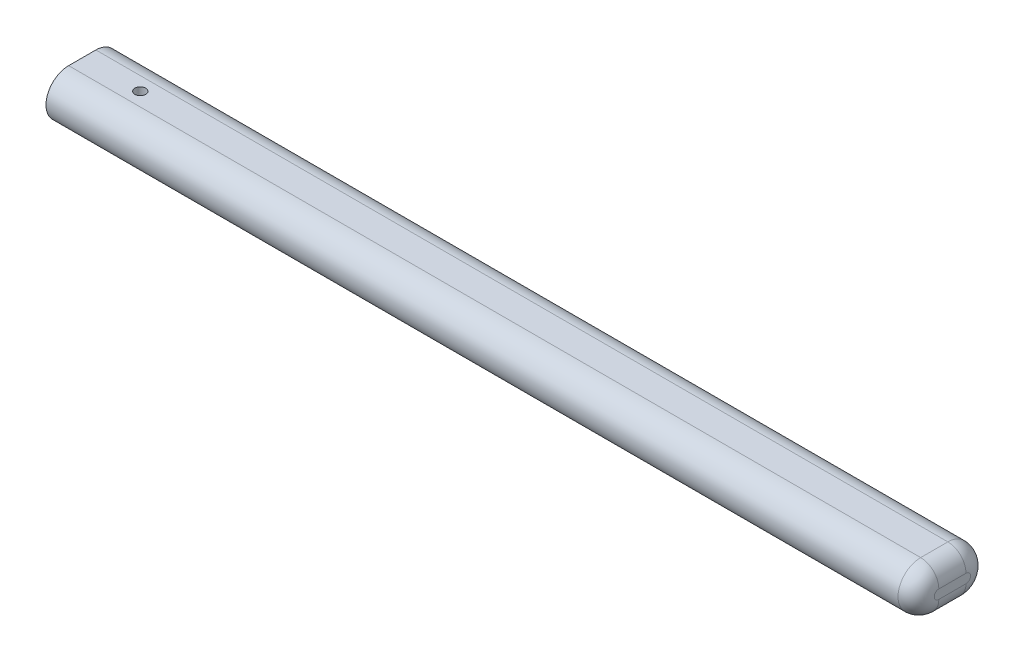
ISO-10303-21;
HEADER;
FILE_DESCRIPTION(('STEP AP214'),'2;1');
FILE_NAME('part.step','',(''),(''),'','','');
FILE_SCHEMA(('AUTOMOTIVE_DESIGN { 1 0 10303 214 1 1 1 1 }'));
ENDSEC;
DATA;
#1=APPLICATION_CONTEXT('core data for automotive mechanical design processes');
#2=APPLICATION_PROTOCOL_DEFINITION('international standard','automotive_design',2000,#1);
#3=PRODUCT_CONTEXT('',#1,'mechanical');
#4=PRODUCT('Part','Part','',(#3));
#5=PRODUCT_RELATED_PRODUCT_CATEGORY('part','',(#4));
#6=PRODUCT_DEFINITION_FORMATION('','',#4);
#7=PRODUCT_DEFINITION_CONTEXT('part definition',#1,'design');
#8=PRODUCT_DEFINITION('design','',#6,#7);
#9=PRODUCT_DEFINITION_SHAPE('','',#8);
#10=(LENGTH_UNIT() NAMED_UNIT(*) SI_UNIT(.MILLI.,.METRE.));
#11=(NAMED_UNIT(*) PLANE_ANGLE_UNIT() SI_UNIT($,.RADIAN.));
#12=(NAMED_UNIT(*) SI_UNIT($,.STERADIAN.) SOLID_ANGLE_UNIT());
#13=UNCERTAINTY_MEASURE_WITH_UNIT(LENGTH_MEASURE(1.E-05),#10,'distance_accuracy_value','');
#14=(GEOMETRIC_REPRESENTATION_CONTEXT(3) GLOBAL_UNCERTAINTY_ASSIGNED_CONTEXT((#13)) GLOBAL_UNIT_ASSIGNED_CONTEXT((#10,
#11,#12)) REPRESENTATION_CONTEXT('',''));
#15=CARTESIAN_POINT('',(0.,0.,0.));
#16=DIRECTION('',(0.,0.,1.));
#17=DIRECTION('',(1.,0.,0.));
#18=AXIS2_PLACEMENT_3D('',#15,#16,#17);
#19=CARTESIAN_POINT('',(480.,0.,0.));
#20=DIRECTION('',(-1.,0.,0.));
#21=DIRECTION('',(0.,0.,1.));
#22=AXIS2_PLACEMENT_3D('',#19,#20,#21);
#23=CYLINDRICAL_SURFACE('',#22,12.5);
#24=DIRECTION('',(-1.,0.,0.));
#25=VECTOR('',#24,1.);
#26=CARTESIAN_POINT('',(480.,-12.5,0.));
#27=LINE('',#26,#25);
#28=CARTESIAN_POINT('',(470.,-12.5,0.));
#29=VERTEX_POINT('',#28);
#30=CARTESIAN_POINT('',(0.,-12.5,0.));
#31=VERTEX_POINT('',#30);
#32=EDGE_CURVE('E85',#29,#31,#27,.T.);
#33=ORIENTED_EDGE('',*,*,#32,.F.);
#34=CARTESIAN_POINT('',(470.,0.,0.));
#35=DIRECTION('',(1.,0.,0.));
#36=DIRECTION('',(0.,0.,-1.));
#37=AXIS2_PLACEMENT_3D('',#34,#35,#36);
#38=CIRCLE('',#37,12.5);
#39=CARTESIAN_POINT('',(470.,12.5,0.));
#40=VERTEX_POINT('',#39);
#41=EDGE_CURVE('E11',#29,#40,#38,.F.);
#42=ORIENTED_EDGE('',*,*,#41,.T.);
#43=DIRECTION('',(-1.,0.,0.));
#44=VECTOR('',#43,1.);
#45=CARTESIAN_POINT('',(480.,12.5,0.));
#46=LINE('',#45,#44);
#47=CARTESIAN_POINT('',(0.,12.5,0.));
#48=VERTEX_POINT('',#47);
#49=EDGE_CURVE('E105',#40,#48,#46,.T.);
#50=ORIENTED_EDGE('',*,*,#49,.T.);
#51=CARTESIAN_POINT('',(0.,0.,0.));
#52=DIRECTION('',(1.,0.,0.));
#53=DIRECTION('',(0.,0.,-1.));
#54=AXIS2_PLACEMENT_3D('',#51,#52,#53);
#55=CIRCLE('',#54,12.5);
#56=EDGE_CURVE('E100',#48,#31,#55,.T.);
#57=ORIENTED_EDGE('',*,*,#56,.T.);
#58=EDGE_LOOP('',(#33,#42,#50,#57));
#59=FACE_BOUND('',#58,.T.);
#60=ADVANCED_FACE('F33',(#59),#23,.T.);
#61=CARTESIAN_POINT('',(480.,-12.5,0.));
#62=DIRECTION('',(0.,1.,0.));
#63=DIRECTION('',(0.,0.,1.));
#64=AXIS2_PLACEMENT_3D('',#61,#62,#63);
#65=PLANE('',#64);
#66=CARTESIAN_POINT('',(32.,-12.5,-7.5));
#67=DIRECTION('',(0.,1.,0.));
#68=DIRECTION('',(0.,0.,1.));
#69=AXIS2_PLACEMENT_3D('',#66,#67,#68);
#70=CIRCLE('',#69,3.);
#71=CARTESIAN_POINT('',(32.,-12.5,-4.5));
#72=VERTEX_POINT('',#71);
#73=EDGE_CURVE('E111',#72,#72,#70,.F.);
#74=ORIENTED_EDGE('',*,*,#73,.F.);
#75=EDGE_LOOP('',(#74));
#76=FACE_BOUND('',#75,.T.);
#77=DIRECTION('',(-1.,0.,0.));
#78=VECTOR('',#77,1.);
#79=CARTESIAN_POINT('',(480.,-12.5,-15.));
#80=LINE('',#79,#78);
#81=CARTESIAN_POINT('',(470.,-12.5,-15.));
#82=VERTEX_POINT('',#81);
#83=CARTESIAN_POINT('',(0.,-12.5,-15.));
#84=VERTEX_POINT('',#83);
#85=EDGE_CURVE('E94',#82,#84,#80,.T.);
#86=ORIENTED_EDGE('',*,*,#85,.F.);
#87=DIRECTION('',(0.,0.,-1.));
#88=VECTOR('',#87,1.);
#89=CARTESIAN_POINT('',(470.,-12.5,0.));
#90=LINE('',#89,#88);
#91=EDGE_CURVE('E42',#82,#29,#90,.F.);
#92=ORIENTED_EDGE('',*,*,#91,.T.);
#93=ORIENTED_EDGE('',*,*,#32,.T.);
#94=DIRECTION('',(0.,0.,-1.));
#95=VECTOR('',#94,1.);
#96=CARTESIAN_POINT('',(0.,-12.5,0.));
#97=LINE('',#96,#95);
#98=EDGE_CURVE('E88',#31,#84,#97,.T.);
#99=ORIENTED_EDGE('',*,*,#98,.T.);
#100=EDGE_LOOP('',(#86,#92,#93,#99));
#101=FACE_BOUND('',#100,.T.);
#102=ADVANCED_FACE('F87',(#76,#101),#65,.F.);
#103=CARTESIAN_POINT('',(480.,0.,-15.));
#104=DIRECTION('',(-1.,0.,0.));
#105=DIRECTION('',(0.,0.,1.));
#106=AXIS2_PLACEMENT_3D('',#103,#104,#105);
#107=CYLINDRICAL_SURFACE('',#106,12.5);
#108=DIRECTION('',(-1.,0.,0.));
#109=VECTOR('',#108,1.);
#110=CARTESIAN_POINT('',(480.,12.5,-15.));
#111=LINE('',#110,#109);
#112=CARTESIAN_POINT('',(470.,12.5,-15.));
#113=VERTEX_POINT('',#112);
#114=CARTESIAN_POINT('',(0.,12.5,-15.));
#115=VERTEX_POINT('',#114);
#116=EDGE_CURVE('E118',#113,#115,#111,.T.);
#117=ORIENTED_EDGE('',*,*,#116,.F.);
#118=CARTESIAN_POINT('',(470.,0.,-15.));
#119=DIRECTION('',(1.,0.,0.));
#120=DIRECTION('',(0.,0.,-1.));
#121=AXIS2_PLACEMENT_3D('',#118,#119,#120);
#122=CIRCLE('',#121,12.5);
#123=EDGE_CURVE('E57',#113,#82,#122,.F.);
#124=ORIENTED_EDGE('',*,*,#123,.T.);
#125=ORIENTED_EDGE('',*,*,#85,.T.);
#126=CARTESIAN_POINT('',(0.,0.,-15.));
#127=DIRECTION('',(1.,0.,0.));
#128=DIRECTION('',(0.,0.,-1.));
#129=AXIS2_PLACEMENT_3D('',#126,#127,#128);
#130=CIRCLE('',#129,12.5);
#131=EDGE_CURVE('E102',#84,#115,#130,.T.);
#132=ORIENTED_EDGE('',*,*,#131,.T.);
#133=EDGE_LOOP('',(#117,#124,#125,#132));
#134=FACE_BOUND('',#133,.T.);
#135=ADVANCED_FACE('F156',(#134),#107,.T.);
#136=CARTESIAN_POINT('',(480.,12.5,0.));
#137=DIRECTION('',(0.,-1.,0.));
#138=DIRECTION('',(0.,0.,-1.));
#139=AXIS2_PLACEMENT_3D('',#136,#137,#138);
#140=PLANE('',#139);
#141=CARTESIAN_POINT('',(32.,12.5,-7.5));
#142=DIRECTION('',(0.,1.,0.));
#143=DIRECTION('',(0.,0.,1.));
#144=AXIS2_PLACEMENT_3D('',#141,#142,#143);
#145=CIRCLE('',#144,3.);
#146=CARTESIAN_POINT('',(32.,12.5,-4.5));
#147=VERTEX_POINT('',#146);
#148=EDGE_CURVE('E200',#147,#147,#145,.T.);
#149=ORIENTED_EDGE('',*,*,#148,.F.);
#150=EDGE_LOOP('',(#149));
#151=FACE_BOUND('',#150,.T.);
#152=ORIENTED_EDGE('',*,*,#49,.F.);
#153=DIRECTION('',(0.,0.,1.));
#154=VECTOR('',#153,1.);
#155=CARTESIAN_POINT('',(470.,12.5,-15.));
#156=LINE('',#155,#154);
#157=EDGE_CURVE('E129',#40,#113,#156,.F.);
#158=ORIENTED_EDGE('',*,*,#157,.T.);
#159=ORIENTED_EDGE('',*,*,#116,.T.);
#160=DIRECTION('',(0.,0.,1.));
#161=VECTOR('',#160,1.);
#162=CARTESIAN_POINT('',(0.,12.5,0.));
#163=LINE('',#162,#161);
#164=EDGE_CURVE('E115',#115,#48,#163,.T.);
#165=ORIENTED_EDGE('',*,*,#164,.T.);
#166=EDGE_LOOP('',(#152,#158,#159,#165));
#167=FACE_BOUND('',#166,.T.);
#168=ADVANCED_FACE('F155',(#151,#167),#140,.F.);
#169=CARTESIAN_POINT('',(480.,0.,0.));
#170=DIRECTION('',(1.,0.,0.));
#171=DIRECTION('',(0.,0.,-1.));
#172=AXIS2_PLACEMENT_3D('',#169,#170,#171);
#173=PLANE('',#172);
#174=CARTESIAN_POINT('',(480.,0.,-15.));
#175=DIRECTION('',(1.,0.,0.));
#176=DIRECTION('',(0.,0.,-1.));
#177=AXIS2_PLACEMENT_3D('',#174,#175,#176);
#178=CIRCLE('',#177,2.5);
#179=CARTESIAN_POINT('',(480.,-2.5,-15.));
#180=VERTEX_POINT('',#179);
#181=CARTESIAN_POINT('',(480.,2.5,-15.));
#182=VERTEX_POINT('',#181);
#183=EDGE_CURVE('E124',#180,#182,#178,.T.);
#184=ORIENTED_EDGE('',*,*,#183,.T.);
#185=DIRECTION('',(0.,0.,1.));
#186=VECTOR('',#185,1.);
#187=CARTESIAN_POINT('',(480.,2.5,0.));
#188=LINE('',#187,#186);
#189=CARTESIAN_POINT('',(480.,2.5,0.));
#190=VERTEX_POINT('',#189);
#191=EDGE_CURVE('E126',#182,#190,#188,.T.);
#192=ORIENTED_EDGE('',*,*,#191,.T.);
#193=CARTESIAN_POINT('',(480.,0.,0.));
#194=DIRECTION('',(1.,0.,0.));
#195=DIRECTION('',(0.,0.,-1.));
#196=AXIS2_PLACEMENT_3D('',#193,#194,#195);
#197=CIRCLE('',#196,2.5);
#198=CARTESIAN_POINT('',(480.,-2.5,0.));
#199=VERTEX_POINT('',#198);
#200=EDGE_CURVE('E93',#190,#199,#197,.T.);
#201=ORIENTED_EDGE('',*,*,#200,.T.);
#202=DIRECTION('',(0.,0.,-1.));
#203=VECTOR('',#202,1.);
#204=CARTESIAN_POINT('',(480.,-2.5,-15.));
#205=LINE('',#204,#203);
#206=EDGE_CURVE('E122',#199,#180,#205,.T.);
#207=ORIENTED_EDGE('',*,*,#206,.T.);
#208=EDGE_LOOP('',(#184,#192,#201,#207));
#209=FACE_BOUND('',#208,.T.);
#210=ADVANCED_FACE('F148',(#209),#173,.T.);
#211=CARTESIAN_POINT('',(0.,0.,0.));
#212=DIRECTION('',(1.,0.,0.));
#213=DIRECTION('',(0.,0.,-1.));
#214=AXIS2_PLACEMENT_3D('',#211,#212,#213);
#215=PLANE('',#214);
#216=ORIENTED_EDGE('',*,*,#56,.F.);
#217=ORIENTED_EDGE('',*,*,#164,.F.);
#218=ORIENTED_EDGE('',*,*,#131,.F.);
#219=ORIENTED_EDGE('',*,*,#98,.F.);
#220=EDGE_LOOP('',(#216,#217,#218,#219));
#221=FACE_BOUND('',#220,.T.);
#222=ADVANCED_FACE('F98',(#221),#215,.F.);
#223=CARTESIAN_POINT('',(470.,-2.5,0.));
#224=DIRECTION('',(0.,0.,1.));
#225=DIRECTION('',(1.,0.,0.));
#226=AXIS2_PLACEMENT_3D('',#223,#224,#225);
#227=CYLINDRICAL_SURFACE('',#226,10.);
#228=CARTESIAN_POINT('',(470.,-2.5,0.));
#229=DIRECTION('',(0.,0.,1.));
#230=DIRECTION('',(1.,0.,0.));
#231=AXIS2_PLACEMENT_3D('',#228,#229,#230);
#232=CIRCLE('',#231,10.);
#233=EDGE_CURVE('E109',#29,#199,#232,.T.);
#234=ORIENTED_EDGE('',*,*,#233,.F.);
#235=ORIENTED_EDGE('',*,*,#91,.F.);
#236=CARTESIAN_POINT('',(470.,-2.5,-15.));
#237=DIRECTION('',(0.,0.,-1.));
#238=DIRECTION('',(0.,1.,0.));
#239=AXIS2_PLACEMENT_3D('',#236,#237,#238);
#240=CIRCLE('',#239,10.);
#241=EDGE_CURVE('E37',#180,#82,#240,.T.);
#242=ORIENTED_EDGE('',*,*,#241,.F.);
#243=ORIENTED_EDGE('',*,*,#206,.F.);
#244=EDGE_LOOP('',(#234,#235,#242,#243));
#245=FACE_BOUND('',#244,.T.);
#246=ADVANCED_FACE('F35',(#245),#227,.T.);
#247=CARTESIAN_POINT('',(470.,0.,-15.));
#248=DIRECTION('',(1.,0.,0.));
#249=DIRECTION('',(0.,0.,-1.));
#250=AXIS2_PLACEMENT_3D('',#247,#248,#249);
#251=DEGENERATE_TOROIDAL_SURFACE('',#250,2.5,10.,.T.);
#252=ORIENTED_EDGE('',*,*,#241,.T.);
#253=ORIENTED_EDGE('',*,*,#123,.F.);
#254=CARTESIAN_POINT('',(470.,2.5,-15.));
#255=DIRECTION('',(0.,0.,1.));
#256=DIRECTION('',(1.,0.,0.));
#257=AXIS2_PLACEMENT_3D('',#254,#255,#256);
#258=CIRCLE('',#257,10.);
#259=EDGE_CURVE('E136',#182,#113,#258,.T.);
#260=ORIENTED_EDGE('',*,*,#259,.F.);
#261=ORIENTED_EDGE('',*,*,#183,.F.);
#262=EDGE_LOOP('',(#252,#253,#260,#261));
#263=FACE_BOUND('',#262,.T.);
#264=ADVANCED_FACE('F176',(#263),#251,.T.);
#265=CARTESIAN_POINT('',(470.,0.,0.));
#266=DIRECTION('',(1.,0.,0.));
#267=DIRECTION('',(0.,0.,-1.));
#268=AXIS2_PLACEMENT_3D('',#265,#266,#267);
#269=DEGENERATE_TOROIDAL_SURFACE('',#268,2.5,10.,.T.);
#270=ORIENTED_EDGE('',*,*,#233,.T.);
#271=ORIENTED_EDGE('',*,*,#200,.F.);
#272=CARTESIAN_POINT('',(470.,2.5,0.));
#273=DIRECTION('',(0.,0.,-1.));
#274=DIRECTION('',(-1.,0.,0.));
#275=AXIS2_PLACEMENT_3D('',#272,#273,#274);
#276=CIRCLE('',#275,10.);
#277=EDGE_CURVE('E134',#40,#190,#276,.T.);
#278=ORIENTED_EDGE('',*,*,#277,.F.);
#279=ORIENTED_EDGE('',*,*,#41,.F.);
#280=EDGE_LOOP('',(#270,#271,#278,#279));
#281=FACE_BOUND('',#280,.T.);
#282=ADVANCED_FACE('F141',(#281),#269,.T.);
#283=CARTESIAN_POINT('',(470.,2.5,0.));
#284=DIRECTION('',(0.,0.,-1.));
#285=DIRECTION('',(-1.,0.,0.));
#286=AXIS2_PLACEMENT_3D('',#283,#284,#285);
#287=CYLINDRICAL_SURFACE('',#286,10.);
#288=ORIENTED_EDGE('',*,*,#259,.T.);
#289=ORIENTED_EDGE('',*,*,#157,.F.);
#290=ORIENTED_EDGE('',*,*,#277,.T.);
#291=ORIENTED_EDGE('',*,*,#191,.F.);
#292=EDGE_LOOP('',(#288,#289,#290,#291));
#293=FACE_BOUND('',#292,.T.);
#294=ADVANCED_FACE('F152',(#293),#287,.T.);
#295=CARTESIAN_POINT('',(32.,-20.9852813742386,-7.5));
#296=DIRECTION('',(0.,1.,0.));
#297=DIRECTION('',(0.,0.,1.));
#298=AXIS2_PLACEMENT_3D('',#295,#296,#297);
#299=CYLINDRICAL_SURFACE('',#298,3.);
#300=ORIENTED_EDGE('',*,*,#73,.T.);
#301=EDGE_LOOP('',(#300));
#302=FACE_BOUND('',#301,.T.);
#303=ORIENTED_EDGE('',*,*,#148,.T.);
#304=EDGE_LOOP('',(#303));
#305=FACE_BOUND('',#304,.T.);
#306=ADVANCED_FACE('F174',(#302,#305),#299,.F.);
#307=CLOSED_SHELL('',(#60,#102,#135,#168,#210,#222,#246,#264,#282,#294,#306));
#308=MANIFOLD_SOLID_BREP('B2',#307);
#309=ADVANCED_BREP_SHAPE_REPRESENTATION('',(#18,#308),#14);
#310=SHAPE_DEFINITION_REPRESENTATION(#9,#309);
ENDSEC;
END-ISO-10303-21;
